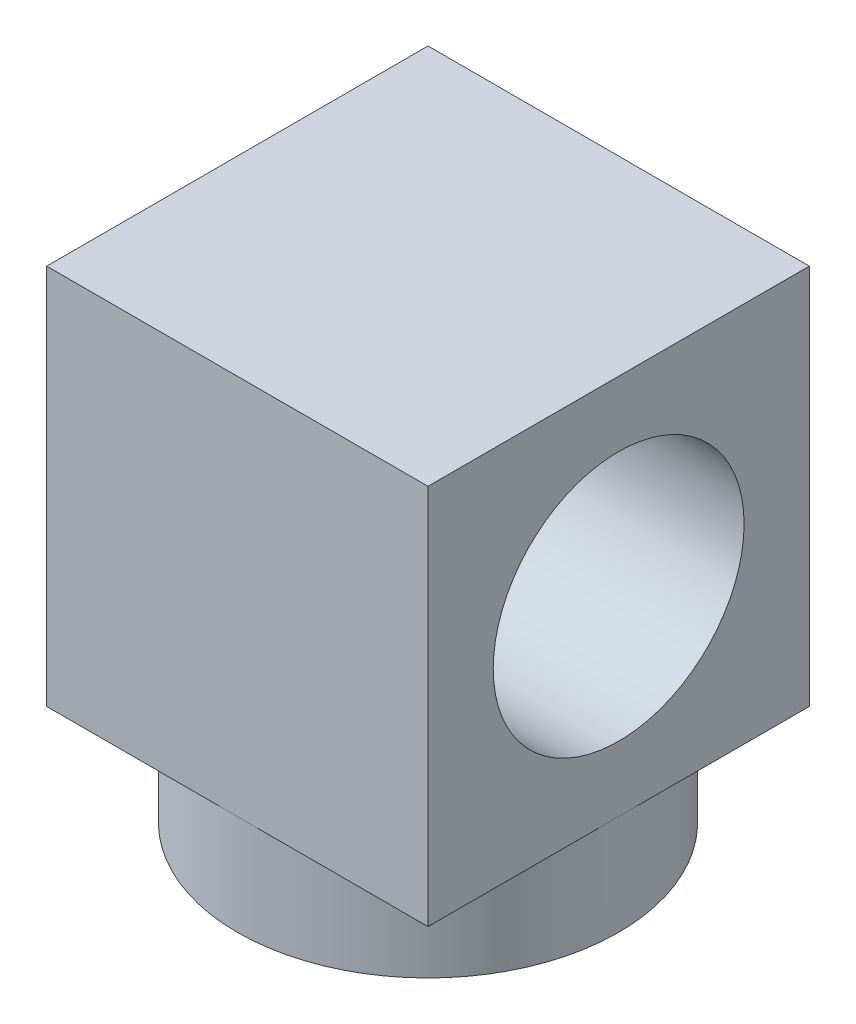
ISO-10303-21;
HEADER;
FILE_DESCRIPTION(('STEP AP214'),'2;1');
FILE_NAME('part.step','',(''),(''),'','','');
FILE_SCHEMA(('AUTOMOTIVE_DESIGN { 1 0 10303 214 1 1 1 1 }'));
ENDSEC;
DATA;
#1=APPLICATION_CONTEXT('core data for automotive mechanical design processes');
#2=APPLICATION_PROTOCOL_DEFINITION('international standard','automotive_design',2000,#1);
#3=PRODUCT_CONTEXT('',#1,'mechanical');
#4=PRODUCT('Part','Part','',(#3));
#5=PRODUCT_RELATED_PRODUCT_CATEGORY('part','',(#4));
#6=PRODUCT_DEFINITION_FORMATION('','',#4);
#7=PRODUCT_DEFINITION_CONTEXT('part definition',#1,'design');
#8=PRODUCT_DEFINITION('design','',#6,#7);
#9=PRODUCT_DEFINITION_SHAPE('','',#8);
#10=(LENGTH_UNIT() NAMED_UNIT(*) SI_UNIT(.MILLI.,.METRE.));
#11=(NAMED_UNIT(*) PLANE_ANGLE_UNIT() SI_UNIT($,.RADIAN.));
#12=(NAMED_UNIT(*) SI_UNIT($,.STERADIAN.) SOLID_ANGLE_UNIT());
#13=UNCERTAINTY_MEASURE_WITH_UNIT(LENGTH_MEASURE(1.E-05),#10,'distance_accuracy_value','');
#14=(GEOMETRIC_REPRESENTATION_CONTEXT(3) GLOBAL_UNCERTAINTY_ASSIGNED_CONTEXT((#13)) GLOBAL_UNIT_ASSIGNED_CONTEXT((#10,
#11,#12)) REPRESENTATION_CONTEXT('',''));
#15=CARTESIAN_POINT('',(0.,0.,0.));
#16=DIRECTION('',(0.,0.,1.));
#17=DIRECTION('',(1.,0.,0.));
#18=AXIS2_PLACEMENT_3D('',#15,#16,#17);
#19=CARTESIAN_POINT('',(0.,2.54,0.));
#20=DIRECTION('',(0.,-1.,0.));
#21=DIRECTION('',(0.,0.,-1.));
#22=AXIS2_PLACEMENT_3D('',#19,#20,#21);
#23=CYLINDRICAL_SURFACE('',#22,4.826);
#24=CARTESIAN_POINT('',(0.,2.54,0.));
#25=DIRECTION('',(0.,1.,0.));
#26=DIRECTION('',(0.,0.,1.));
#27=AXIS2_PLACEMENT_3D('',#24,#25,#26);
#28=CIRCLE('',#27,4.826);
#29=CARTESIAN_POINT('',(0.,2.54,4.826));
#30=VERTEX_POINT('',#29);
#31=CARTESIAN_POINT('',(4.826,2.54,0.));
#32=VERTEX_POINT('',#31);
#33=EDGE_CURVE('E11',#30,#32,#28,.T.);
#34=ORIENTED_EDGE('',*,*,#33,.F.);
#35=CARTESIAN_POINT('',(-4.826,2.54,0.));
#36=VERTEX_POINT('',#35);
#37=EDGE_CURVE('E42',#36,#30,#28,.T.);
#38=ORIENTED_EDGE('',*,*,#37,.F.);
#39=CARTESIAN_POINT('',(0.,2.54,-4.826));
#40=VERTEX_POINT('',#39);
#41=EDGE_CURVE('E52',#40,#36,#28,.T.);
#42=ORIENTED_EDGE('',*,*,#41,.F.);
#43=EDGE_CURVE('E41',#32,#40,#28,.T.);
#44=ORIENTED_EDGE('',*,*,#43,.F.);
#45=EDGE_LOOP('',(#34,#38,#42,#44));
#46=FACE_BOUND('',#45,.T.);
#47=CARTESIAN_POINT('',(0.,0.,0.));
#48=DIRECTION('',(0.,1.,0.));
#49=DIRECTION('',(0.,0.,1.));
#50=AXIS2_PLACEMENT_3D('',#47,#48,#49);
#51=CIRCLE('',#50,4.826);
#52=CARTESIAN_POINT('',(0.,0.,4.826));
#53=VERTEX_POINT('',#52);
#54=EDGE_CURVE('E36',#53,#53,#51,.T.);
#55=ORIENTED_EDGE('',*,*,#54,.T.);
#56=EDGE_LOOP('',(#55));
#57=FACE_BOUND('',#56,.T.);
#58=ADVANCED_FACE('F33',(#46,#57),#23,.T.);
#59=CARTESIAN_POINT('',(0.,0.,0.));
#60=DIRECTION('',(0.,1.,0.));
#61=DIRECTION('',(0.,0.,1.));
#62=AXIS2_PLACEMENT_3D('',#59,#60,#61);
#63=PLANE('',#62);
#64=ORIENTED_EDGE('',*,*,#54,.F.);
#65=EDGE_LOOP('',(#64));
#66=FACE_BOUND('',#65,.T.);
#67=ADVANCED_FACE('F177',(#66),#63,.F.);
#68=CARTESIAN_POINT('',(0.,2.54,0.));
#69=DIRECTION('',(0.,-1.,0.));
#70=DIRECTION('',(0.,0.,-1.));
#71=AXIS2_PLACEMENT_3D('',#68,#69,#70);
#72=PLANE('',#71);
#73=DIRECTION('',(1.,0.,0.));
#74=VECTOR('',#73,1.);
#75=CARTESIAN_POINT('',(4.826,2.54,4.826));
#76=LINE('',#75,#74);
#77=CARTESIAN_POINT('',(4.826,2.54,4.826));
#78=VERTEX_POINT('',#77);
#79=EDGE_CURVE('E129',#30,#78,#76,.T.);
#80=ORIENTED_EDGE('',*,*,#79,.F.);
#81=ORIENTED_EDGE('',*,*,#33,.T.);
#82=DIRECTION('',(0.,0.,-1.));
#83=VECTOR('',#82,1.);
#84=CARTESIAN_POINT('',(4.826,2.54,-4.826));
#85=LINE('',#84,#83);
#86=EDGE_CURVE('E123',#78,#32,#85,.T.);
#87=ORIENTED_EDGE('',*,*,#86,.F.);
#88=EDGE_LOOP('',(#80,#81,#87));
#89=FACE_BOUND('',#88,.T.);
#90=ADVANCED_FACE('F159',(#89),#72,.T.);
#91=CARTESIAN_POINT('',(4.826,2.54,-4.826));
#92=VERTEX_POINT('',#91);
#93=EDGE_CURVE('E126',#32,#92,#85,.T.);
#94=ORIENTED_EDGE('',*,*,#93,.F.);
#95=ORIENTED_EDGE('',*,*,#43,.T.);
#96=DIRECTION('',(-1.,0.,0.));
#97=VECTOR('',#96,1.);
#98=CARTESIAN_POINT('',(4.826,2.54,-4.826));
#99=LINE('',#98,#97);
#100=EDGE_CURVE('E104',#92,#40,#99,.T.);
#101=ORIENTED_EDGE('',*,*,#100,.F.);
#102=EDGE_LOOP('',(#94,#95,#101));
#103=FACE_BOUND('',#102,.T.);
#104=ADVANCED_FACE('F162',(#103),#72,.T.);
#105=CARTESIAN_POINT('',(-4.826,2.54,-4.826));
#106=VERTEX_POINT('',#105);
#107=EDGE_CURVE('E122',#40,#106,#99,.T.);
#108=ORIENTED_EDGE('',*,*,#107,.F.);
#109=ORIENTED_EDGE('',*,*,#41,.T.);
#110=DIRECTION('',(0.,0.,1.));
#111=VECTOR('',#110,1.);
#112=CARTESIAN_POINT('',(-4.826,2.54,-4.826));
#113=LINE('',#112,#111);
#114=EDGE_CURVE('E130',#106,#36,#113,.T.);
#115=ORIENTED_EDGE('',*,*,#114,.F.);
#116=EDGE_LOOP('',(#108,#109,#115));
#117=FACE_BOUND('',#116,.T.);
#118=ADVANCED_FACE('F167',(#117),#72,.T.);
#119=CARTESIAN_POINT('',(-4.826,12.192,-4.826));
#120=DIRECTION('',(1.,0.,0.));
#121=DIRECTION('',(0.,0.,-1.));
#122=AXIS2_PLACEMENT_3D('',#119,#120,#121);
#123=PLANE('',#122);
#124=CARTESIAN_POINT('',(-4.826,7.366,0.));
#125=DIRECTION('',(1.,0.,0.));
#126=DIRECTION('',(0.,0.,-1.));
#127=AXIS2_PLACEMENT_3D('',#124,#125,#126);
#128=CIRCLE('',#127,3.175);
#129=CARTESIAN_POINT('',(-4.826,7.366,-3.175));
#130=VERTEX_POINT('',#129);
#131=EDGE_CURVE('E137',#130,#130,#128,.T.);
#132=ORIENTED_EDGE('',*,*,#131,.T.);
#133=EDGE_LOOP('',(#132));
#134=FACE_BOUND('',#133,.T.);
#135=ORIENTED_EDGE('',*,*,#114,.T.);
#136=CARTESIAN_POINT('',(-4.826,2.54,4.826));
#137=VERTEX_POINT('',#136);
#138=EDGE_CURVE('E109',#36,#137,#113,.T.);
#139=ORIENTED_EDGE('',*,*,#138,.T.);
#140=DIRECTION('',(0.,-1.,0.));
#141=VECTOR('',#140,1.);
#142=CARTESIAN_POINT('',(-4.826,12.192,4.826));
#143=LINE('',#142,#141);
#144=CARTESIAN_POINT('',(-4.826,12.192,4.826));
#145=VERTEX_POINT('',#144);
#146=EDGE_CURVE('E89',#145,#137,#143,.T.);
#147=ORIENTED_EDGE('',*,*,#146,.F.);
#148=DIRECTION('',(0.,0.,1.));
#149=VECTOR('',#148,1.);
#150=CARTESIAN_POINT('',(-4.826,12.192,-4.826));
#151=LINE('',#150,#149);
#152=CARTESIAN_POINT('',(-4.826,12.192,-4.826));
#153=VERTEX_POINT('',#152);
#154=EDGE_CURVE('E95',#153,#145,#151,.T.);
#155=ORIENTED_EDGE('',*,*,#154,.F.);
#156=DIRECTION('',(0.,-1.,0.));
#157=VECTOR('',#156,1.);
#158=CARTESIAN_POINT('',(-4.826,12.192,-4.826));
#159=LINE('',#158,#157);
#160=EDGE_CURVE('E118',#153,#106,#159,.T.);
#161=ORIENTED_EDGE('',*,*,#160,.T.);
#162=EDGE_LOOP('',(#135,#139,#147,#155,#161));
#163=FACE_BOUND('',#162,.T.);
#164=ADVANCED_FACE('F107',(#134,#163),#123,.F.);
#165=CARTESIAN_POINT('',(4.826,12.192,4.826));
#166=DIRECTION('',(0.,0.,-1.));
#167=DIRECTION('',(-1.,0.,0.));
#168=AXIS2_PLACEMENT_3D('',#165,#166,#167);
#169=PLANE('',#168);
#170=EDGE_CURVE('E127',#137,#30,#76,.T.);
#171=ORIENTED_EDGE('',*,*,#170,.T.);
#172=ORIENTED_EDGE('',*,*,#79,.T.);
#173=DIRECTION('',(0.,-1.,0.));
#174=VECTOR('',#173,1.);
#175=CARTESIAN_POINT('',(4.826,12.192,4.826));
#176=LINE('',#175,#174);
#177=CARTESIAN_POINT('',(4.826,12.192,4.826));
#178=VERTEX_POINT('',#177);
#179=EDGE_CURVE('E91',#178,#78,#176,.T.);
#180=ORIENTED_EDGE('',*,*,#179,.F.);
#181=DIRECTION('',(1.,0.,0.));
#182=VECTOR('',#181,1.);
#183=CARTESIAN_POINT('',(4.826,12.192,4.826));
#184=LINE('',#183,#182);
#185=EDGE_CURVE('E84',#145,#178,#184,.T.);
#186=ORIENTED_EDGE('',*,*,#185,.F.);
#187=ORIENTED_EDGE('',*,*,#146,.T.);
#188=EDGE_LOOP('',(#171,#172,#180,#186,#187));
#189=FACE_BOUND('',#188,.T.);
#190=ADVANCED_FACE('F87',(#189),#169,.F.);
#191=CARTESIAN_POINT('',(4.826,12.192,-4.826));
#192=DIRECTION('',(-1.,0.,0.));
#193=DIRECTION('',(0.,0.,1.));
#194=AXIS2_PLACEMENT_3D('',#191,#192,#193);
#195=PLANE('',#194);
#196=CARTESIAN_POINT('',(4.826,7.366,0.));
#197=DIRECTION('',(1.,0.,0.));
#198=DIRECTION('',(0.,0.,-1.));
#199=AXIS2_PLACEMENT_3D('',#196,#197,#198);
#200=CIRCLE('',#199,3.175);
#201=CARTESIAN_POINT('',(4.826,7.366,-3.175));
#202=VERTEX_POINT('',#201);
#203=EDGE_CURVE('E134',#202,#202,#200,.T.);
#204=ORIENTED_EDGE('',*,*,#203,.F.);
#205=EDGE_LOOP('',(#204));
#206=FACE_BOUND('',#205,.T.);
#207=ORIENTED_EDGE('',*,*,#86,.T.);
#208=ORIENTED_EDGE('',*,*,#93,.T.);
#209=DIRECTION('',(0.,-1.,0.));
#210=VECTOR('',#209,1.);
#211=CARTESIAN_POINT('',(4.826,12.192,-4.826));
#212=LINE('',#211,#210);
#213=CARTESIAN_POINT('',(4.826,12.192,-4.826));
#214=VERTEX_POINT('',#213);
#215=EDGE_CURVE('E113',#214,#92,#212,.T.);
#216=ORIENTED_EDGE('',*,*,#215,.F.);
#217=DIRECTION('',(0.,0.,-1.));
#218=VECTOR('',#217,1.);
#219=CARTESIAN_POINT('',(4.826,12.192,-4.826));
#220=LINE('',#219,#218);
#221=EDGE_CURVE('E94',#178,#214,#220,.T.);
#222=ORIENTED_EDGE('',*,*,#221,.F.);
#223=ORIENTED_EDGE('',*,*,#179,.T.);
#224=EDGE_LOOP('',(#207,#208,#216,#222,#223));
#225=FACE_BOUND('',#224,.T.);
#226=ADVANCED_FACE('F149',(#206,#225),#195,.F.);
#227=CARTESIAN_POINT('',(4.826,12.192,-4.826));
#228=DIRECTION('',(0.,0.,1.));
#229=DIRECTION('',(1.,0.,0.));
#230=AXIS2_PLACEMENT_3D('',#227,#228,#229);
#231=PLANE('',#230);
#232=ORIENTED_EDGE('',*,*,#100,.T.);
#233=ORIENTED_EDGE('',*,*,#107,.T.);
#234=ORIENTED_EDGE('',*,*,#160,.F.);
#235=DIRECTION('',(-1.,0.,0.));
#236=VECTOR('',#235,1.);
#237=CARTESIAN_POINT('',(4.826,12.192,-4.826));
#238=LINE('',#237,#236);
#239=EDGE_CURVE('E100',#214,#153,#238,.T.);
#240=ORIENTED_EDGE('',*,*,#239,.F.);
#241=ORIENTED_EDGE('',*,*,#215,.T.);
#242=EDGE_LOOP('',(#232,#233,#234,#240,#241));
#243=FACE_BOUND('',#242,.T.);
#244=ADVANCED_FACE('F152',(#243),#231,.F.);
#245=CARTESIAN_POINT('',(0.,12.192,0.));
#246=DIRECTION('',(0.,-1.,0.));
#247=DIRECTION('',(0.,0.,-1.));
#248=AXIS2_PLACEMENT_3D('',#245,#246,#247);
#249=PLANE('',#248);
#250=ORIENTED_EDGE('',*,*,#154,.T.);
#251=ORIENTED_EDGE('',*,*,#185,.T.);
#252=ORIENTED_EDGE('',*,*,#221,.T.);
#253=ORIENTED_EDGE('',*,*,#239,.T.);
#254=EDGE_LOOP('',(#250,#251,#252,#253));
#255=FACE_BOUND('',#254,.T.);
#256=ADVANCED_FACE('F98',(#255),#249,.F.);
#257=ORIENTED_EDGE('',*,*,#138,.F.);
#258=ORIENTED_EDGE('',*,*,#37,.T.);
#259=ORIENTED_EDGE('',*,*,#170,.F.);
#260=EDGE_LOOP('',(#257,#258,#259));
#261=FACE_BOUND('',#260,.T.);
#262=ADVANCED_FACE('F145',(#261),#72,.T.);
#263=CARTESIAN_POINT('',(-4.826,7.366,0.));
#264=DIRECTION('',(1.,0.,0.));
#265=DIRECTION('',(0.,0.,-1.));
#266=AXIS2_PLACEMENT_3D('',#263,#264,#265);
#267=CYLINDRICAL_SURFACE('',#266,3.175);
#268=ORIENTED_EDGE('',*,*,#131,.F.);
#269=EDGE_LOOP('',(#268));
#270=FACE_BOUND('',#269,.T.);
#271=ORIENTED_EDGE('',*,*,#203,.T.);
#272=EDGE_LOOP('',(#271));
#273=FACE_BOUND('',#272,.T.);
#274=ADVANCED_FACE('F142',(#270,#273),#267,.F.);
#275=CLOSED_SHELL('',(#58,#67,#90,#104,#118,#164,#190,#226,#244,#256,#262,#274));
#276=MANIFOLD_SOLID_BREP('B2',#275);
#277=ADVANCED_BREP_SHAPE_REPRESENTATION('',(#18,#276),#14);
#278=SHAPE_DEFINITION_REPRESENTATION(#9,#277);
ENDSEC;
END-ISO-10303-21;
